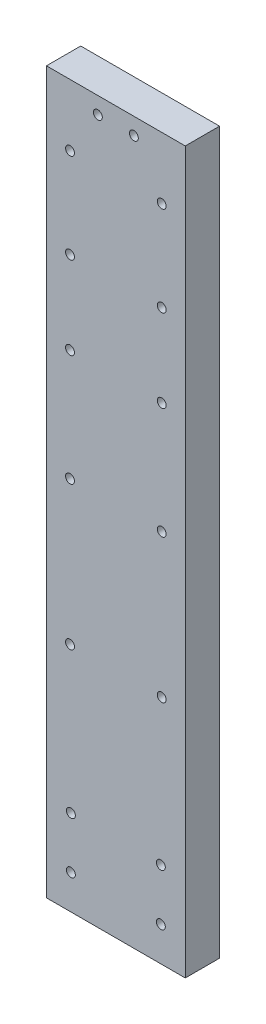
ISO-10303-21;
HEADER;
FILE_DESCRIPTION(('STEP AP214'),'2;1');
FILE_NAME('part.step','',(''),(''),'','','');
FILE_SCHEMA(('AUTOMOTIVE_DESIGN { 1 0 10303 214 1 1 1 1 }'));
ENDSEC;
DATA;
#1=APPLICATION_CONTEXT('core data for automotive mechanical design processes');
#2=APPLICATION_PROTOCOL_DEFINITION('international standard','automotive_design',2000,#1);
#3=PRODUCT_CONTEXT('',#1,'mechanical');
#4=PRODUCT('Part','Part','',(#3));
#5=PRODUCT_RELATED_PRODUCT_CATEGORY('part','',(#4));
#6=PRODUCT_DEFINITION_FORMATION('','',#4);
#7=PRODUCT_DEFINITION_CONTEXT('part definition',#1,'design');
#8=PRODUCT_DEFINITION('design','',#6,#7);
#9=PRODUCT_DEFINITION_SHAPE('','',#8);
#10=(LENGTH_UNIT() NAMED_UNIT(*) SI_UNIT(.MILLI.,.METRE.));
#11=(NAMED_UNIT(*) PLANE_ANGLE_UNIT() SI_UNIT($,.RADIAN.));
#12=(NAMED_UNIT(*) SI_UNIT($,.STERADIAN.) SOLID_ANGLE_UNIT());
#13=UNCERTAINTY_MEASURE_WITH_UNIT(LENGTH_MEASURE(1.E-05),#10,'distance_accuracy_value','');
#14=(GEOMETRIC_REPRESENTATION_CONTEXT(3) GLOBAL_UNCERTAINTY_ASSIGNED_CONTEXT((#13)) GLOBAL_UNIT_ASSIGNED_CONTEXT((#10,
#11,#12)) REPRESENTATION_CONTEXT('',''));
#15=CARTESIAN_POINT('',(0.,0.,0.));
#16=DIRECTION('',(0.,0.,1.));
#17=DIRECTION('',(1.,0.,0.));
#18=AXIS2_PLACEMENT_3D('',#15,#16,#17);
#19=CARTESIAN_POINT('',(0.,0.,4.));
#20=DIRECTION('',(0.,0.,-1.));
#21=DIRECTION('',(-1.,0.,0.));
#22=AXIS2_PLACEMENT_3D('',#19,#20,#21);
#23=PLANE('',#22);
#24=CARTESIAN_POINT('',(10.2,82.135,4.));
#25=DIRECTION('',(0.,0.,1.));
#26=DIRECTION('',(1.,0.,0.));
#27=AXIS2_PLACEMENT_3D('',#24,#25,#26);
#28=CIRCLE('',#27,0.519960121099865);
#29=CARTESIAN_POINT('',(10.7199601210999,82.135,4.));
#30=VERTEX_POINT('',#29);
#31=EDGE_CURVE('E194',#30,#30,#28,.T.);
#32=ORIENTED_EDGE('',*,*,#31,.F.);
#33=EDGE_LOOP('',(#32));
#34=FACE_BOUND('',#33,.T.);
#35=CARTESIAN_POINT('',(13.45,76.885,4.));
#36=DIRECTION('',(0.,0.,1.));
#37=DIRECTION('',(1.,0.,0.));
#38=AXIS2_PLACEMENT_3D('',#35,#36,#37);
#39=CIRCLE('',#38,0.519960121099861);
#40=CARTESIAN_POINT('',(13.9699601210999,76.885,4.));
#41=VERTEX_POINT('',#40);
#42=EDGE_CURVE('E182',#41,#41,#39,.T.);
#43=ORIENTED_EDGE('',*,*,#42,.F.);
#44=EDGE_LOOP('',(#43));
#45=FACE_BOUND('',#44,.T.);
#46=CARTESIAN_POINT('',(13.35,4.,4.));
#47=DIRECTION('',(0.,0.,1.));
#48=DIRECTION('',(-1.,0.,0.));
#49=AXIS2_PLACEMENT_3D('',#46,#47,#48);
#50=CIRCLE('',#49,0.519960121099866);
#51=CARTESIAN_POINT('',(12.8300398789001,4.,4.));
#52=VERTEX_POINT('',#51);
#53=EDGE_CURVE('E170',#52,#52,#50,.T.);
#54=ORIENTED_EDGE('',*,*,#53,.F.);
#55=EDGE_LOOP('',(#54));
#56=FACE_BOUND('',#55,.T.);
#57=CARTESIAN_POINT('',(2.85,4.,4.));
#58=DIRECTION('',(0.,0.,1.));
#59=DIRECTION('',(1.,0.,0.));
#60=AXIS2_PLACEMENT_3D('',#57,#58,#59);
#61=CIRCLE('',#60,0.519960121099866);
#62=CARTESIAN_POINT('',(3.36996012109987,4.,4.));
#63=VERTEX_POINT('',#62);
#64=EDGE_CURVE('E158',#63,#63,#61,.T.);
#65=ORIENTED_EDGE('',*,*,#64,.F.);
#66=EDGE_LOOP('',(#65));
#67=FACE_BOUND('',#66,.T.);
#68=CARTESIAN_POINT('',(13.45,66.385,4.));
#69=DIRECTION('',(0.,0.,1.));
#70=DIRECTION('',(1.,0.,0.));
#71=AXIS2_PLACEMENT_3D('',#68,#69,#70);
#72=CIRCLE('',#71,0.519960121099861);
#73=CARTESIAN_POINT('',(13.9699601210999,66.385,4.));
#74=VERTEX_POINT('',#73);
#75=EDGE_CURVE('E146',#74,#74,#72,.T.);
#76=ORIENTED_EDGE('',*,*,#75,.F.);
#77=EDGE_LOOP('',(#76));
#78=FACE_BOUND('',#77,.T.);
#79=CARTESIAN_POINT('',(13.45,56.74,4.));
#80=DIRECTION('',(0.,0.,1.));
#81=DIRECTION('',(1.,0.,0.));
#82=AXIS2_PLACEMENT_3D('',#79,#80,#81);
#83=CIRCLE('',#82,0.519960121099861);
#84=CARTESIAN_POINT('',(13.9699601210999,56.74,4.));
#85=VERTEX_POINT('',#84);
#86=EDGE_CURVE('E134',#85,#85,#83,.T.);
#87=ORIENTED_EDGE('',*,*,#86,.F.);
#88=EDGE_LOOP('',(#87));
#89=FACE_BOUND('',#88,.T.);
#90=CARTESIAN_POINT('',(13.45,43.74,4.));
#91=DIRECTION('',(0.,0.,1.));
#92=DIRECTION('',(1.,0.,0.));
#93=AXIS2_PLACEMENT_3D('',#90,#91,#92);
#94=CIRCLE('',#93,0.519960121099861);
#95=CARTESIAN_POINT('',(13.9699601210999,43.74,4.));
#96=VERTEX_POINT('',#95);
#97=EDGE_CURVE('E122',#96,#96,#94,.T.);
#98=ORIENTED_EDGE('',*,*,#97,.F.);
#99=EDGE_LOOP('',(#98));
#100=FACE_BOUND('',#99,.T.);
#101=CARTESIAN_POINT('',(13.45,27.,4.));
#102=DIRECTION('',(0.,0.,1.));
#103=DIRECTION('',(1.,0.,0.));
#104=AXIS2_PLACEMENT_3D('',#101,#102,#103);
#105=CIRCLE('',#104,0.519960121099865);
#106=CARTESIAN_POINT('',(13.9699601210999,27.,4.));
#107=VERTEX_POINT('',#106);
#108=EDGE_CURVE('E101',#107,#107,#105,.T.);
#109=ORIENTED_EDGE('',*,*,#108,.F.);
#110=EDGE_LOOP('',(#109));
#111=FACE_BOUND('',#110,.T.);
#112=DIRECTION('',(-1.,0.,0.));
#113=VECTOR('',#112,1.);
#114=CARTESIAN_POINT('',(16.2,84.09,4.));
#115=LINE('',#114,#113);
#116=CARTESIAN_POINT('',(16.2,84.09,4.));
#117=VERTEX_POINT('',#116);
#118=CARTESIAN_POINT('',(0.,84.09,4.));
#119=VERTEX_POINT('',#118);
#120=EDGE_CURVE('E86',#117,#119,#115,.T.);
#121=ORIENTED_EDGE('',*,*,#120,.T.);
#122=DIRECTION('',(0.,-1.,0.));
#123=VECTOR('',#122,1.);
#124=CARTESIAN_POINT('',(0.,0.,4.));
#125=LINE('',#124,#123);
#126=CARTESIAN_POINT('',(0.,0.,4.));
#127=VERTEX_POINT('',#126);
#128=EDGE_CURVE('E81',#119,#127,#125,.T.);
#129=ORIENTED_EDGE('',*,*,#128,.T.);
#130=DIRECTION('',(1.,0.,0.));
#131=VECTOR('',#130,1.);
#132=CARTESIAN_POINT('',(0.,0.,4.));
#133=LINE('',#132,#131);
#134=CARTESIAN_POINT('',(16.2,0.,4.));
#135=VERTEX_POINT('',#134);
#136=EDGE_CURVE('E84',#127,#135,#133,.T.);
#137=ORIENTED_EDGE('',*,*,#136,.T.);
#138=DIRECTION('',(0.,1.,0.));
#139=VECTOR('',#138,1.);
#140=CARTESIAN_POINT('',(16.2,0.,4.));
#141=LINE('',#140,#139);
#142=EDGE_CURVE('E51',#135,#117,#141,.T.);
#143=ORIENTED_EDGE('',*,*,#142,.T.);
#144=EDGE_LOOP('',(#121,#129,#137,#143));
#145=FACE_BOUND('',#144,.T.);
#146=CARTESIAN_POINT('',(2.75,27.,4.));
#147=DIRECTION('',(0.,0.,1.));
#148=DIRECTION('',(1.,0.,0.));
#149=AXIS2_PLACEMENT_3D('',#146,#147,#148);
#150=CIRCLE('',#149,0.519960121099867);
#151=CARTESIAN_POINT('',(3.26996012109987,27.,4.));
#152=VERTEX_POINT('',#151);
#153=EDGE_CURVE('E116',#152,#152,#150,.T.);
#154=ORIENTED_EDGE('',*,*,#153,.F.);
#155=EDGE_LOOP('',(#154));
#156=FACE_BOUND('',#155,.T.);
#157=CARTESIAN_POINT('',(2.75,43.74,4.));
#158=DIRECTION('',(0.,0.,1.));
#159=DIRECTION('',(1.,0.,0.));
#160=AXIS2_PLACEMENT_3D('',#157,#158,#159);
#161=CIRCLE('',#160,0.519960121099859);
#162=CARTESIAN_POINT('',(3.26996012109986,43.74,4.));
#163=VERTEX_POINT('',#162);
#164=EDGE_CURVE('E128',#163,#163,#161,.T.);
#165=ORIENTED_EDGE('',*,*,#164,.F.);
#166=EDGE_LOOP('',(#165));
#167=FACE_BOUND('',#166,.T.);
#168=CARTESIAN_POINT('',(2.75,56.74,4.));
#169=DIRECTION('',(0.,0.,1.));
#170=DIRECTION('',(1.,0.,0.));
#171=AXIS2_PLACEMENT_3D('',#168,#169,#170);
#172=CIRCLE('',#171,0.519960121099859);
#173=CARTESIAN_POINT('',(3.26996012109986,56.74,4.));
#174=VERTEX_POINT('',#173);
#175=EDGE_CURVE('E140',#174,#174,#172,.T.);
#176=ORIENTED_EDGE('',*,*,#175,.F.);
#177=EDGE_LOOP('',(#176));
#178=FACE_BOUND('',#177,.T.);
#179=CARTESIAN_POINT('',(2.85,10.,4.));
#180=DIRECTION('',(0.,0.,1.));
#181=DIRECTION('',(1.,0.,0.));
#182=AXIS2_PLACEMENT_3D('',#179,#180,#181);
#183=CIRCLE('',#182,0.519960121099866);
#184=CARTESIAN_POINT('',(3.36996012109986,10.,4.));
#185=VERTEX_POINT('',#184);
#186=EDGE_CURVE('E152',#185,#185,#183,.T.);
#187=ORIENTED_EDGE('',*,*,#186,.F.);
#188=EDGE_LOOP('',(#187));
#189=FACE_BOUND('',#188,.T.);
#190=CARTESIAN_POINT('',(13.3499999999999,10.,4.));
#191=DIRECTION('',(0.,0.,1.));
#192=DIRECTION('',(-1.,0.,0.));
#193=AXIS2_PLACEMENT_3D('',#190,#191,#192);
#194=CIRCLE('',#193,0.519960121099864);
#195=CARTESIAN_POINT('',(12.8300398789,10.,4.));
#196=VERTEX_POINT('',#195);
#197=EDGE_CURVE('E164',#196,#196,#194,.T.);
#198=ORIENTED_EDGE('',*,*,#197,.F.);
#199=EDGE_LOOP('',(#198));
#200=FACE_BOUND('',#199,.T.);
#201=CARTESIAN_POINT('',(2.74999999999862,66.385,4.));
#202=DIRECTION('',(0.,0.,1.));
#203=DIRECTION('',(1.,0.,0.));
#204=AXIS2_PLACEMENT_3D('',#201,#202,#203);
#205=CIRCLE('',#204,0.519960121099858);
#206=CARTESIAN_POINT('',(3.26996012109847,66.385,4.));
#207=VERTEX_POINT('',#206);
#208=EDGE_CURVE('E176',#207,#207,#205,.T.);
#209=ORIENTED_EDGE('',*,*,#208,.F.);
#210=EDGE_LOOP('',(#209));
#211=FACE_BOUND('',#210,.T.);
#212=CARTESIAN_POINT('',(2.74999999999862,76.885,4.));
#213=DIRECTION('',(0.,0.,1.));
#214=DIRECTION('',(1.,0.,0.));
#215=AXIS2_PLACEMENT_3D('',#212,#213,#214);
#216=CIRCLE('',#215,0.519960121099858);
#217=CARTESIAN_POINT('',(3.26996012109847,76.885,4.));
#218=VERTEX_POINT('',#217);
#219=EDGE_CURVE('E188',#218,#218,#216,.T.);
#220=ORIENTED_EDGE('',*,*,#219,.F.);
#221=EDGE_LOOP('',(#220));
#222=FACE_BOUND('',#221,.T.);
#223=CARTESIAN_POINT('',(6.,82.135,4.));
#224=DIRECTION('',(0.,0.,1.));
#225=DIRECTION('',(1.,0.,0.));
#226=AXIS2_PLACEMENT_3D('',#223,#224,#225);
#227=CIRCLE('',#226,0.519960121099861);
#228=CARTESIAN_POINT('',(6.51996012109986,82.135,4.));
#229=VERTEX_POINT('',#228);
#230=EDGE_CURVE('E200',#229,#229,#227,.T.);
#231=ORIENTED_EDGE('',*,*,#230,.F.);
#232=EDGE_LOOP('',(#231));
#233=FACE_BOUND('',#232,.T.);
#234=ADVANCED_FACE('F34',(#34,#45,#56,#67,#78,#89,#100,#111,#145,#156,#167,#178,#189,#200,#211,
#222,#233),#23,.F.);
#235=CARTESIAN_POINT('',(0.,0.,0.));
#236=DIRECTION('',(0.,0.,-1.));
#237=DIRECTION('',(-1.,0.,0.));
#238=AXIS2_PLACEMENT_3D('',#235,#236,#237);
#239=PLANE('',#238);
#240=CARTESIAN_POINT('',(10.2,82.135,0.));
#241=DIRECTION('',(0.,0.,1.));
#242=DIRECTION('',(1.,0.,0.));
#243=AXIS2_PLACEMENT_3D('',#240,#241,#242);
#244=CIRCLE('',#243,0.519960121099865);
#245=CARTESIAN_POINT('',(10.7199601210999,82.135,0.));
#246=VERTEX_POINT('',#245);
#247=EDGE_CURVE('E197',#246,#246,#244,.T.);
#248=ORIENTED_EDGE('',*,*,#247,.T.);
#249=EDGE_LOOP('',(#248));
#250=FACE_BOUND('',#249,.T.);
#251=CARTESIAN_POINT('',(13.45,76.885,0.));
#252=DIRECTION('',(0.,0.,1.));
#253=DIRECTION('',(1.,0.,0.));
#254=AXIS2_PLACEMENT_3D('',#251,#252,#253);
#255=CIRCLE('',#254,0.519960121099861);
#256=CARTESIAN_POINT('',(13.9699601210999,76.885,0.));
#257=VERTEX_POINT('',#256);
#258=EDGE_CURVE('E185',#257,#257,#255,.T.);
#259=ORIENTED_EDGE('',*,*,#258,.T.);
#260=EDGE_LOOP('',(#259));
#261=FACE_BOUND('',#260,.T.);
#262=CARTESIAN_POINT('',(13.35,4.,0.));
#263=DIRECTION('',(0.,0.,1.));
#264=DIRECTION('',(-1.,0.,0.));
#265=AXIS2_PLACEMENT_3D('',#262,#263,#264);
#266=CIRCLE('',#265,0.519960121099866);
#267=CARTESIAN_POINT('',(12.8300398789001,4.,0.));
#268=VERTEX_POINT('',#267);
#269=EDGE_CURVE('E173',#268,#268,#266,.T.);
#270=ORIENTED_EDGE('',*,*,#269,.T.);
#271=EDGE_LOOP('',(#270));
#272=FACE_BOUND('',#271,.T.);
#273=CARTESIAN_POINT('',(2.85,4.,0.));
#274=DIRECTION('',(0.,0.,1.));
#275=DIRECTION('',(1.,0.,0.));
#276=AXIS2_PLACEMENT_3D('',#273,#274,#275);
#277=CIRCLE('',#276,0.519960121099866);
#278=CARTESIAN_POINT('',(3.36996012109987,4.,0.));
#279=VERTEX_POINT('',#278);
#280=EDGE_CURVE('E161',#279,#279,#277,.T.);
#281=ORIENTED_EDGE('',*,*,#280,.T.);
#282=EDGE_LOOP('',(#281));
#283=FACE_BOUND('',#282,.T.);
#284=CARTESIAN_POINT('',(13.45,66.385,0.));
#285=DIRECTION('',(0.,0.,1.));
#286=DIRECTION('',(1.,0.,0.));
#287=AXIS2_PLACEMENT_3D('',#284,#285,#286);
#288=CIRCLE('',#287,0.519960121099861);
#289=CARTESIAN_POINT('',(13.9699601210999,66.385,0.));
#290=VERTEX_POINT('',#289);
#291=EDGE_CURVE('E149',#290,#290,#288,.T.);
#292=ORIENTED_EDGE('',*,*,#291,.T.);
#293=EDGE_LOOP('',(#292));
#294=FACE_BOUND('',#293,.T.);
#295=CARTESIAN_POINT('',(13.45,56.74,0.));
#296=DIRECTION('',(0.,0.,1.));
#297=DIRECTION('',(1.,0.,0.));
#298=AXIS2_PLACEMENT_3D('',#295,#296,#297);
#299=CIRCLE('',#298,0.519960121099861);
#300=CARTESIAN_POINT('',(13.9699601210999,56.74,0.));
#301=VERTEX_POINT('',#300);
#302=EDGE_CURVE('E137',#301,#301,#299,.T.);
#303=ORIENTED_EDGE('',*,*,#302,.T.);
#304=EDGE_LOOP('',(#303));
#305=FACE_BOUND('',#304,.T.);
#306=CARTESIAN_POINT('',(13.45,43.74,0.));
#307=DIRECTION('',(0.,0.,1.));
#308=DIRECTION('',(1.,0.,0.));
#309=AXIS2_PLACEMENT_3D('',#306,#307,#308);
#310=CIRCLE('',#309,0.519960121099861);
#311=CARTESIAN_POINT('',(13.9699601210999,43.74,0.));
#312=VERTEX_POINT('',#311);
#313=EDGE_CURVE('E125',#312,#312,#310,.T.);
#314=ORIENTED_EDGE('',*,*,#313,.T.);
#315=EDGE_LOOP('',(#314));
#316=FACE_BOUND('',#315,.T.);
#317=CARTESIAN_POINT('',(13.45,27.,0.));
#318=DIRECTION('',(0.,0.,1.));
#319=DIRECTION('',(1.,0.,0.));
#320=AXIS2_PLACEMENT_3D('',#317,#318,#319);
#321=CIRCLE('',#320,0.519960121099865);
#322=CARTESIAN_POINT('',(13.9699601210999,27.,0.));
#323=VERTEX_POINT('',#322);
#324=EDGE_CURVE('E113',#323,#323,#321,.T.);
#325=ORIENTED_EDGE('',*,*,#324,.T.);
#326=EDGE_LOOP('',(#325));
#327=FACE_BOUND('',#326,.T.);
#328=DIRECTION('',(-1.,0.,0.));
#329=VECTOR('',#328,1.);
#330=CARTESIAN_POINT('',(16.2,84.09,0.));
#331=LINE('',#330,#329);
#332=CARTESIAN_POINT('',(16.2,84.09,0.));
#333=VERTEX_POINT('',#332);
#334=CARTESIAN_POINT('',(0.,84.09,0.));
#335=VERTEX_POINT('',#334);
#336=EDGE_CURVE('E98',#333,#335,#331,.T.);
#337=ORIENTED_EDGE('',*,*,#336,.F.);
#338=DIRECTION('',(0.,1.,0.));
#339=VECTOR('',#338,1.);
#340=CARTESIAN_POINT('',(16.2,0.,0.));
#341=LINE('',#340,#339);
#342=CARTESIAN_POINT('',(16.2,0.,0.));
#343=VERTEX_POINT('',#342);
#344=EDGE_CURVE('E74',#343,#333,#341,.T.);
#345=ORIENTED_EDGE('',*,*,#344,.F.);
#346=DIRECTION('',(1.,0.,0.));
#347=VECTOR('',#346,1.);
#348=CARTESIAN_POINT('',(0.,0.,0.));
#349=LINE('',#348,#347);
#350=CARTESIAN_POINT('',(0.,0.,0.));
#351=VERTEX_POINT('',#350);
#352=EDGE_CURVE('E68',#351,#343,#349,.T.);
#353=ORIENTED_EDGE('',*,*,#352,.F.);
#354=DIRECTION('',(0.,-1.,0.));
#355=VECTOR('',#354,1.);
#356=CARTESIAN_POINT('',(0.,0.,0.));
#357=LINE('',#356,#355);
#358=EDGE_CURVE('E90',#335,#351,#357,.T.);
#359=ORIENTED_EDGE('',*,*,#358,.F.);
#360=EDGE_LOOP('',(#337,#345,#353,#359));
#361=FACE_BOUND('',#360,.T.);
#362=CARTESIAN_POINT('',(2.75,27.,0.));
#363=DIRECTION('',(0.,0.,1.));
#364=DIRECTION('',(1.,0.,0.));
#365=AXIS2_PLACEMENT_3D('',#362,#363,#364);
#366=CIRCLE('',#365,0.519960121099867);
#367=CARTESIAN_POINT('',(3.26996012109987,27.,0.));
#368=VERTEX_POINT('',#367);
#369=EDGE_CURVE('E119',#368,#368,#366,.T.);
#370=ORIENTED_EDGE('',*,*,#369,.T.);
#371=EDGE_LOOP('',(#370));
#372=FACE_BOUND('',#371,.T.);
#373=CARTESIAN_POINT('',(2.75,43.74,0.));
#374=DIRECTION('',(0.,0.,1.));
#375=DIRECTION('',(1.,0.,0.));
#376=AXIS2_PLACEMENT_3D('',#373,#374,#375);
#377=CIRCLE('',#376,0.519960121099859);
#378=CARTESIAN_POINT('',(3.26996012109986,43.74,0.));
#379=VERTEX_POINT('',#378);
#380=EDGE_CURVE('E131',#379,#379,#377,.T.);
#381=ORIENTED_EDGE('',*,*,#380,.T.);
#382=EDGE_LOOP('',(#381));
#383=FACE_BOUND('',#382,.T.);
#384=CARTESIAN_POINT('',(2.75,56.74,0.));
#385=DIRECTION('',(0.,0.,1.));
#386=DIRECTION('',(1.,0.,0.));
#387=AXIS2_PLACEMENT_3D('',#384,#385,#386);
#388=CIRCLE('',#387,0.519960121099859);
#389=CARTESIAN_POINT('',(3.26996012109986,56.74,0.));
#390=VERTEX_POINT('',#389);
#391=EDGE_CURVE('E143',#390,#390,#388,.T.);
#392=ORIENTED_EDGE('',*,*,#391,.T.);
#393=EDGE_LOOP('',(#392));
#394=FACE_BOUND('',#393,.T.);
#395=CARTESIAN_POINT('',(2.85,10.,0.));
#396=DIRECTION('',(0.,0.,1.));
#397=DIRECTION('',(1.,0.,0.));
#398=AXIS2_PLACEMENT_3D('',#395,#396,#397);
#399=CIRCLE('',#398,0.519960121099866);
#400=CARTESIAN_POINT('',(3.36996012109986,10.,0.));
#401=VERTEX_POINT('',#400);
#402=EDGE_CURVE('E155',#401,#401,#399,.T.);
#403=ORIENTED_EDGE('',*,*,#402,.T.);
#404=EDGE_LOOP('',(#403));
#405=FACE_BOUND('',#404,.T.);
#406=CARTESIAN_POINT('',(13.3499999999999,10.,0.));
#407=DIRECTION('',(0.,0.,1.));
#408=DIRECTION('',(-1.,0.,0.));
#409=AXIS2_PLACEMENT_3D('',#406,#407,#408);
#410=CIRCLE('',#409,0.519960121099864);
#411=CARTESIAN_POINT('',(12.8300398789,10.,0.));
#412=VERTEX_POINT('',#411);
#413=EDGE_CURVE('E167',#412,#412,#410,.T.);
#414=ORIENTED_EDGE('',*,*,#413,.T.);
#415=EDGE_LOOP('',(#414));
#416=FACE_BOUND('',#415,.T.);
#417=CARTESIAN_POINT('',(2.74999999999862,66.385,0.));
#418=DIRECTION('',(0.,0.,1.));
#419=DIRECTION('',(1.,0.,0.));
#420=AXIS2_PLACEMENT_3D('',#417,#418,#419);
#421=CIRCLE('',#420,0.519960121099858);
#422=CARTESIAN_POINT('',(3.26996012109847,66.385,0.));
#423=VERTEX_POINT('',#422);
#424=EDGE_CURVE('E179',#423,#423,#421,.T.);
#425=ORIENTED_EDGE('',*,*,#424,.T.);
#426=EDGE_LOOP('',(#425));
#427=FACE_BOUND('',#426,.T.);
#428=CARTESIAN_POINT('',(2.74999999999862,76.885,0.));
#429=DIRECTION('',(0.,0.,1.));
#430=DIRECTION('',(1.,0.,0.));
#431=AXIS2_PLACEMENT_3D('',#428,#429,#430);
#432=CIRCLE('',#431,0.519960121099858);
#433=CARTESIAN_POINT('',(3.26996012109847,76.885,0.));
#434=VERTEX_POINT('',#433);
#435=EDGE_CURVE('E191',#434,#434,#432,.T.);
#436=ORIENTED_EDGE('',*,*,#435,.T.);
#437=EDGE_LOOP('',(#436));
#438=FACE_BOUND('',#437,.T.);
#439=CARTESIAN_POINT('',(6.,82.135,0.));
#440=DIRECTION('',(0.,0.,1.));
#441=DIRECTION('',(1.,0.,0.));
#442=AXIS2_PLACEMENT_3D('',#439,#440,#441);
#443=CIRCLE('',#442,0.519960121099861);
#444=CARTESIAN_POINT('',(6.51996012109986,82.135,0.));
#445=VERTEX_POINT('',#444);
#446=EDGE_CURVE('E203',#445,#445,#443,.T.);
#447=ORIENTED_EDGE('',*,*,#446,.T.);
#448=EDGE_LOOP('',(#447));
#449=FACE_BOUND('',#448,.T.);
#450=ADVANCED_FACE('F109',(#250,#261,#272,#283,#294,#305,#316,#327,#361,#372,#383,#394,#405,
#416,#427,#438,#449),#239,.T.);
#451=CARTESIAN_POINT('',(16.2,84.09,4.));
#452=DIRECTION('',(0.,-1.,0.));
#453=DIRECTION('',(0.,0.,-1.));
#454=AXIS2_PLACEMENT_3D('',#451,#452,#453);
#455=PLANE('',#454);
#456=ORIENTED_EDGE('',*,*,#336,.T.);
#457=DIRECTION('',(0.,0.,-1.));
#458=VECTOR('',#457,1.);
#459=CARTESIAN_POINT('',(0.,84.09,4.));
#460=LINE('',#459,#458);
#461=EDGE_CURVE('E11',#119,#335,#460,.T.);
#462=ORIENTED_EDGE('',*,*,#461,.F.);
#463=ORIENTED_EDGE('',*,*,#120,.F.);
#464=DIRECTION('',(0.,0.,-1.));
#465=VECTOR('',#464,1.);
#466=CARTESIAN_POINT('',(16.2,84.09,4.));
#467=LINE('',#466,#465);
#468=EDGE_CURVE('E94',#117,#333,#467,.T.);
#469=ORIENTED_EDGE('',*,*,#468,.T.);
#470=EDGE_LOOP('',(#456,#462,#463,#469));
#471=FACE_BOUND('',#470,.T.);
#472=ADVANCED_FACE('F36',(#471),#455,.F.);
#473=CARTESIAN_POINT('',(0.,0.,4.));
#474=DIRECTION('',(1.,0.,0.));
#475=DIRECTION('',(0.,0.,-1.));
#476=AXIS2_PLACEMENT_3D('',#473,#474,#475);
#477=PLANE('',#476);
#478=ORIENTED_EDGE('',*,*,#358,.T.);
#479=DIRECTION('',(0.,0.,-1.));
#480=VECTOR('',#479,1.);
#481=CARTESIAN_POINT('',(0.,0.,4.));
#482=LINE('',#481,#480);
#483=EDGE_CURVE('E43',#127,#351,#482,.T.);
#484=ORIENTED_EDGE('',*,*,#483,.F.);
#485=ORIENTED_EDGE('',*,*,#128,.F.);
#486=ORIENTED_EDGE('',*,*,#461,.T.);
#487=EDGE_LOOP('',(#478,#484,#485,#486));
#488=FACE_BOUND('',#487,.T.);
#489=ADVANCED_FACE('F89',(#488),#477,.F.);
#490=CARTESIAN_POINT('',(0.,0.,4.));
#491=DIRECTION('',(0.,1.,0.));
#492=DIRECTION('',(0.,0.,1.));
#493=AXIS2_PLACEMENT_3D('',#490,#491,#492);
#494=PLANE('',#493);
#495=ORIENTED_EDGE('',*,*,#352,.T.);
#496=DIRECTION('',(0.,0.,-1.));
#497=VECTOR('',#496,1.);
#498=CARTESIAN_POINT('',(16.2,0.,4.));
#499=LINE('',#498,#497);
#500=EDGE_CURVE('E91',#135,#343,#499,.T.);
#501=ORIENTED_EDGE('',*,*,#500,.F.);
#502=ORIENTED_EDGE('',*,*,#136,.F.);
#503=ORIENTED_EDGE('',*,*,#483,.T.);
#504=EDGE_LOOP('',(#495,#501,#502,#503));
#505=FACE_BOUND('',#504,.T.);
#506=ADVANCED_FACE('F92',(#505),#494,.F.);
#507=CARTESIAN_POINT('',(16.2,0.,4.));
#508=DIRECTION('',(-1.,0.,0.));
#509=DIRECTION('',(0.,0.,1.));
#510=AXIS2_PLACEMENT_3D('',#507,#508,#509);
#511=PLANE('',#510);
#512=ORIENTED_EDGE('',*,*,#344,.T.);
#513=ORIENTED_EDGE('',*,*,#468,.F.);
#514=ORIENTED_EDGE('',*,*,#142,.F.);
#515=ORIENTED_EDGE('',*,*,#500,.T.);
#516=EDGE_LOOP('',(#512,#513,#514,#515));
#517=FACE_BOUND('',#516,.T.);
#518=ADVANCED_FACE('F106',(#517),#511,.F.);
#519=CARTESIAN_POINT('',(13.45,27.,4.));
#520=DIRECTION('',(0.,0.,-1.));
#521=DIRECTION('',(-1.,0.,0.));
#522=AXIS2_PLACEMENT_3D('',#519,#520,#521);
#523=CYLINDRICAL_SURFACE('',#522,0.519960121099865);
#524=ORIENTED_EDGE('',*,*,#108,.T.);
#525=EDGE_LOOP('',(#524));
#526=FACE_BOUND('',#525,.T.);
#527=ORIENTED_EDGE('',*,*,#324,.F.);
#528=EDGE_LOOP('',(#527));
#529=FACE_BOUND('',#528,.T.);
#530=ADVANCED_FACE('F223',(#526,#529),#523,.F.);
#531=CARTESIAN_POINT('',(2.75,27.,4.));
#532=DIRECTION('',(0.,0.,-1.));
#533=DIRECTION('',(-1.,0.,0.));
#534=AXIS2_PLACEMENT_3D('',#531,#532,#533);
#535=CYLINDRICAL_SURFACE('',#534,0.519960121099867);
#536=ORIENTED_EDGE('',*,*,#153,.T.);
#537=EDGE_LOOP('',(#536));
#538=FACE_BOUND('',#537,.T.);
#539=ORIENTED_EDGE('',*,*,#369,.F.);
#540=EDGE_LOOP('',(#539));
#541=FACE_BOUND('',#540,.T.);
#542=ADVANCED_FACE('F269',(#538,#541),#535,.F.);
#543=CARTESIAN_POINT('',(13.45,43.74,4.));
#544=DIRECTION('',(0.,0.,-1.));
#545=DIRECTION('',(-1.,0.,0.));
#546=AXIS2_PLACEMENT_3D('',#543,#544,#545);
#547=CYLINDRICAL_SURFACE('',#546,0.519960121099861);
#548=ORIENTED_EDGE('',*,*,#97,.T.);
#549=EDGE_LOOP('',(#548));
#550=FACE_BOUND('',#549,.T.);
#551=ORIENTED_EDGE('',*,*,#313,.F.);
#552=EDGE_LOOP('',(#551));
#553=FACE_BOUND('',#552,.T.);
#554=ADVANCED_FACE('F277',(#550,#553),#547,.F.);
#555=CARTESIAN_POINT('',(2.75,43.74,4.));
#556=DIRECTION('',(0.,0.,-1.));
#557=DIRECTION('',(-1.,0.,0.));
#558=AXIS2_PLACEMENT_3D('',#555,#556,#557);
#559=CYLINDRICAL_SURFACE('',#558,0.519960121099859);
#560=ORIENTED_EDGE('',*,*,#164,.T.);
#561=EDGE_LOOP('',(#560));
#562=FACE_BOUND('',#561,.T.);
#563=ORIENTED_EDGE('',*,*,#380,.F.);
#564=EDGE_LOOP('',(#563));
#565=FACE_BOUND('',#564,.T.);
#566=ADVANCED_FACE('F285',(#562,#565),#559,.F.);
#567=CARTESIAN_POINT('',(13.45,56.74,4.));
#568=DIRECTION('',(0.,0.,-1.));
#569=DIRECTION('',(-1.,0.,0.));
#570=AXIS2_PLACEMENT_3D('',#567,#568,#569);
#571=CYLINDRICAL_SURFACE('',#570,0.519960121099861);
#572=ORIENTED_EDGE('',*,*,#86,.T.);
#573=EDGE_LOOP('',(#572));
#574=FACE_BOUND('',#573,.T.);
#575=ORIENTED_EDGE('',*,*,#302,.F.);
#576=EDGE_LOOP('',(#575));
#577=FACE_BOUND('',#576,.T.);
#578=ADVANCED_FACE('F294',(#574,#577),#571,.F.);
#579=CARTESIAN_POINT('',(2.75,56.74,4.));
#580=DIRECTION('',(0.,0.,-1.));
#581=DIRECTION('',(-1.,0.,0.));
#582=AXIS2_PLACEMENT_3D('',#579,#580,#581);
#583=CYLINDRICAL_SURFACE('',#582,0.519960121099859);
#584=ORIENTED_EDGE('',*,*,#175,.T.);
#585=EDGE_LOOP('',(#584));
#586=FACE_BOUND('',#585,.T.);
#587=ORIENTED_EDGE('',*,*,#391,.F.);
#588=EDGE_LOOP('',(#587));
#589=FACE_BOUND('',#588,.T.);
#590=ADVANCED_FACE('F303',(#586,#589),#583,.F.);
#591=CARTESIAN_POINT('',(13.45,66.385,4.));
#592=DIRECTION('',(0.,0.,-1.));
#593=DIRECTION('',(-1.,0.,0.));
#594=AXIS2_PLACEMENT_3D('',#591,#592,#593);
#595=CYLINDRICAL_SURFACE('',#594,0.519960121099861);
#596=ORIENTED_EDGE('',*,*,#75,.T.);
#597=EDGE_LOOP('',(#596));
#598=FACE_BOUND('',#597,.T.);
#599=ORIENTED_EDGE('',*,*,#291,.F.);
#600=EDGE_LOOP('',(#599));
#601=FACE_BOUND('',#600,.T.);
#602=ADVANCED_FACE('F312',(#598,#601),#595,.F.);
#603=CARTESIAN_POINT('',(2.85,10.,4.));
#604=DIRECTION('',(0.,0.,-1.));
#605=DIRECTION('',(-1.,0.,0.));
#606=AXIS2_PLACEMENT_3D('',#603,#604,#605);
#607=CYLINDRICAL_SURFACE('',#606,0.519960121099866);
#608=ORIENTED_EDGE('',*,*,#186,.T.);
#609=EDGE_LOOP('',(#608));
#610=FACE_BOUND('',#609,.T.);
#611=ORIENTED_EDGE('',*,*,#402,.F.);
#612=EDGE_LOOP('',(#611));
#613=FACE_BOUND('',#612,.T.);
#614=ADVANCED_FACE('F321',(#610,#613),#607,.F.);
#615=CARTESIAN_POINT('',(2.85,4.,4.));
#616=DIRECTION('',(0.,0.,-1.));
#617=DIRECTION('',(-1.,0.,0.));
#618=AXIS2_PLACEMENT_3D('',#615,#616,#617);
#619=CYLINDRICAL_SURFACE('',#618,0.519960121099866);
#620=ORIENTED_EDGE('',*,*,#64,.T.);
#621=EDGE_LOOP('',(#620));
#622=FACE_BOUND('',#621,.T.);
#623=ORIENTED_EDGE('',*,*,#280,.F.);
#624=EDGE_LOOP('',(#623));
#625=FACE_BOUND('',#624,.T.);
#626=ADVANCED_FACE('F330',(#622,#625),#619,.F.);
#627=CARTESIAN_POINT('',(13.3499999999999,10.,4.));
#628=DIRECTION('',(0.,0.,-1.));
#629=DIRECTION('',(-1.,0.,0.));
#630=AXIS2_PLACEMENT_3D('',#627,#628,#629);
#631=CYLINDRICAL_SURFACE('',#630,0.519960121099864);
#632=ORIENTED_EDGE('',*,*,#197,.T.);
#633=EDGE_LOOP('',(#632));
#634=FACE_BOUND('',#633,.T.);
#635=ORIENTED_EDGE('',*,*,#413,.F.);
#636=EDGE_LOOP('',(#635));
#637=FACE_BOUND('',#636,.T.);
#638=ADVANCED_FACE('F339',(#634,#637),#631,.F.);
#639=CARTESIAN_POINT('',(13.35,4.,4.));
#640=DIRECTION('',(0.,0.,-1.));
#641=DIRECTION('',(-1.,0.,0.));
#642=AXIS2_PLACEMENT_3D('',#639,#640,#641);
#643=CYLINDRICAL_SURFACE('',#642,0.519960121099866);
#644=ORIENTED_EDGE('',*,*,#53,.T.);
#645=EDGE_LOOP('',(#644));
#646=FACE_BOUND('',#645,.T.);
#647=ORIENTED_EDGE('',*,*,#269,.F.);
#648=EDGE_LOOP('',(#647));
#649=FACE_BOUND('',#648,.T.);
#650=ADVANCED_FACE('F348',(#646,#649),#643,.F.);
#651=CARTESIAN_POINT('',(2.74999999999862,66.385,4.));
#652=DIRECTION('',(0.,0.,-1.));
#653=DIRECTION('',(-1.,0.,0.));
#654=AXIS2_PLACEMENT_3D('',#651,#652,#653);
#655=CYLINDRICAL_SURFACE('',#654,0.519960121099858);
#656=ORIENTED_EDGE('',*,*,#208,.T.);
#657=EDGE_LOOP('',(#656));
#658=FACE_BOUND('',#657,.T.);
#659=ORIENTED_EDGE('',*,*,#424,.F.);
#660=EDGE_LOOP('',(#659));
#661=FACE_BOUND('',#660,.T.);
#662=ADVANCED_FACE('F357',(#658,#661),#655,.F.);
#663=CARTESIAN_POINT('',(13.45,76.885,4.));
#664=DIRECTION('',(0.,0.,-1.));
#665=DIRECTION('',(-1.,0.,0.));
#666=AXIS2_PLACEMENT_3D('',#663,#664,#665);
#667=CYLINDRICAL_SURFACE('',#666,0.519960121099861);
#668=ORIENTED_EDGE('',*,*,#42,.T.);
#669=EDGE_LOOP('',(#668));
#670=FACE_BOUND('',#669,.T.);
#671=ORIENTED_EDGE('',*,*,#258,.F.);
#672=EDGE_LOOP('',(#671));
#673=FACE_BOUND('',#672,.T.);
#674=ADVANCED_FACE('F366',(#670,#673),#667,.F.);
#675=CARTESIAN_POINT('',(2.74999999999862,76.885,4.));
#676=DIRECTION('',(0.,0.,-1.));
#677=DIRECTION('',(-1.,0.,0.));
#678=AXIS2_PLACEMENT_3D('',#675,#676,#677);
#679=CYLINDRICAL_SURFACE('',#678,0.519960121099858);
#680=ORIENTED_EDGE('',*,*,#219,.T.);
#681=EDGE_LOOP('',(#680));
#682=FACE_BOUND('',#681,.T.);
#683=ORIENTED_EDGE('',*,*,#435,.F.);
#684=EDGE_LOOP('',(#683));
#685=FACE_BOUND('',#684,.T.);
#686=ADVANCED_FACE('F375',(#682,#685),#679,.F.);
#687=CARTESIAN_POINT('',(10.2,82.135,4.));
#688=DIRECTION('',(0.,0.,-1.));
#689=DIRECTION('',(-1.,0.,0.));
#690=AXIS2_PLACEMENT_3D('',#687,#688,#689);
#691=CYLINDRICAL_SURFACE('',#690,0.519960121099865);
#692=ORIENTED_EDGE('',*,*,#31,.T.);
#693=EDGE_LOOP('',(#692));
#694=FACE_BOUND('',#693,.T.);
#695=ORIENTED_EDGE('',*,*,#247,.F.);
#696=EDGE_LOOP('',(#695));
#697=FACE_BOUND('',#696,.T.);
#698=ADVANCED_FACE('F384',(#694,#697),#691,.F.);
#699=CARTESIAN_POINT('',(6.,82.135,4.));
#700=DIRECTION('',(0.,0.,-1.));
#701=DIRECTION('',(-1.,0.,0.));
#702=AXIS2_PLACEMENT_3D('',#699,#700,#701);
#703=CYLINDRICAL_SURFACE('',#702,0.519960121099861);
#704=ORIENTED_EDGE('',*,*,#230,.T.);
#705=EDGE_LOOP('',(#704));
#706=FACE_BOUND('',#705,.T.);
#707=ORIENTED_EDGE('',*,*,#446,.F.);
#708=EDGE_LOOP('',(#707));
#709=FACE_BOUND('',#708,.T.);
#710=ADVANCED_FACE('F209',(#706,#709),#703,.F.);
#711=CLOSED_SHELL('',(#234,#450,#472,#489,#506,#518,#530,#542,#554,#566,#578,#590,#602,#614,
#626,#638,#650,#662,#674,#686,#698,#710));
#712=MANIFOLD_SOLID_BREP('B2',#711);
#713=ADVANCED_BREP_SHAPE_REPRESENTATION('',(#18,#712),#14);
#714=SHAPE_DEFINITION_REPRESENTATION(#9,#713);
ENDSEC;
END-ISO-10303-21;
